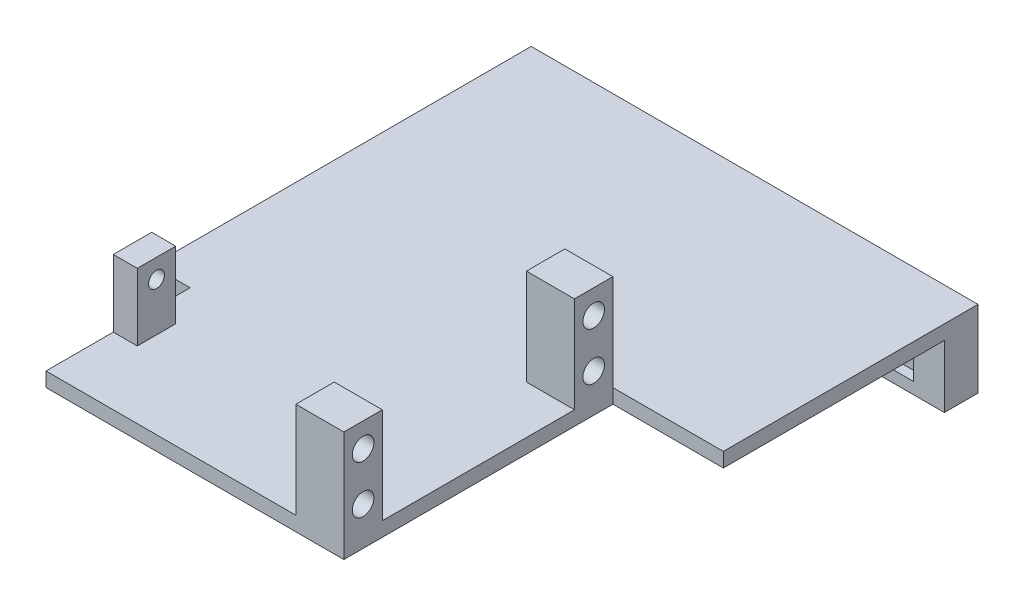
ISO-10303-21;
HEADER;
FILE_DESCRIPTION(('STEP AP214'),'2;1');
FILE_NAME('part.step','',(''),(''),'','','');
FILE_SCHEMA(('AUTOMOTIVE_DESIGN { 1 0 10303 214 1 1 1 1 }'));
ENDSEC;
DATA;
#1=APPLICATION_CONTEXT('core data for automotive mechanical design processes');
#2=APPLICATION_PROTOCOL_DEFINITION('international standard','automotive_design',2000,#1);
#3=PRODUCT_CONTEXT('',#1,'mechanical');
#4=PRODUCT('Part','Part','',(#3));
#5=PRODUCT_RELATED_PRODUCT_CATEGORY('part','',(#4));
#6=PRODUCT_DEFINITION_FORMATION('','',#4);
#7=PRODUCT_DEFINITION_CONTEXT('part definition',#1,'design');
#8=PRODUCT_DEFINITION('design','',#6,#7);
#9=PRODUCT_DEFINITION_SHAPE('','',#8);
#10=(LENGTH_UNIT() NAMED_UNIT(*) SI_UNIT(.MILLI.,.METRE.));
#11=(NAMED_UNIT(*) PLANE_ANGLE_UNIT() SI_UNIT($,.RADIAN.));
#12=(NAMED_UNIT(*) SI_UNIT($,.STERADIAN.) SOLID_ANGLE_UNIT());
#13=UNCERTAINTY_MEASURE_WITH_UNIT(LENGTH_MEASURE(1.E-05),#10,'distance_accuracy_value','');
#14=(GEOMETRIC_REPRESENTATION_CONTEXT(3) GLOBAL_UNCERTAINTY_ASSIGNED_CONTEXT((#13)) GLOBAL_UNIT_ASSIGNED_CONTEXT((#10,
#11,#12)) REPRESENTATION_CONTEXT('',''));
#15=CARTESIAN_POINT('',(0.,0.,0.));
#16=DIRECTION('',(0.,0.,1.));
#17=DIRECTION('',(1.,0.,0.));
#18=AXIS2_PLACEMENT_3D('',#15,#16,#17);
#19=CARTESIAN_POINT('',(0.,-10.,0.));
#20=DIRECTION('',(0.,-1.,0.));
#21=DIRECTION('',(0.,0.,-1.));
#22=AXIS2_PLACEMENT_3D('',#19,#20,#21);
#23=PLANE('',#22);
#24=DIRECTION('',(0.,0.,-1.));
#25=VECTOR('',#24,1.);
#26=CARTESIAN_POINT('',(-52.,-10.,28.));
#27=LINE('',#26,#25);
#28=CARTESIAN_POINT('',(-52.,-10.,6.00000000000001));
#29=VERTEX_POINT('',#28);
#30=CARTESIAN_POINT('',(-52.,-10.,-1.99999999999999));
#31=VERTEX_POINT('',#30);
#32=EDGE_CURVE('E225',#29,#31,#27,.T.);
#33=ORIENTED_EDGE('',*,*,#32,.F.);
#34=DIRECTION('',(-1.,0.,0.));
#35=VECTOR('',#34,1.);
#36=CARTESIAN_POINT('',(-47.,-10.,6.00000000000001));
#37=LINE('',#36,#35);
#38=CARTESIAN_POINT('',(-47.,-10.,6.00000000000001));
#39=VERTEX_POINT('',#38);
#40=EDGE_CURVE('E219',#39,#29,#37,.T.);
#41=ORIENTED_EDGE('',*,*,#40,.F.);
#42=DIRECTION('',(0.,0.,1.));
#43=VECTOR('',#42,1.);
#44=CARTESIAN_POINT('',(-47.,-10.,6.00000000000001));
#45=LINE('',#44,#43);
#46=CARTESIAN_POINT('',(-47.,-10.,14.));
#47=VERTEX_POINT('',#46);
#48=EDGE_CURVE('E205',#39,#47,#45,.T.);
#49=ORIENTED_EDGE('',*,*,#48,.T.);
#50=DIRECTION('',(-1.,0.,0.));
#51=VECTOR('',#50,1.);
#52=CARTESIAN_POINT('',(-47.,-10.,14.));
#53=LINE('',#52,#51);
#54=CARTESIAN_POINT('',(-52.,-10.,14.));
#55=VERTEX_POINT('',#54);
#56=EDGE_CURVE('E226',#47,#55,#53,.T.);
#57=ORIENTED_EDGE('',*,*,#56,.T.);
#58=CARTESIAN_POINT('',(-52.,-10.,28.));
#59=VERTEX_POINT('',#58);
#60=EDGE_CURVE('E270',#59,#55,#27,.T.);
#61=ORIENTED_EDGE('',*,*,#60,.F.);
#62=DIRECTION('',(-1.,0.,0.));
#63=VECTOR('',#62,1.);
#64=CARTESIAN_POINT('',(9.99999999999999,-10.,28.));
#65=LINE('',#64,#63);
#66=CARTESIAN_POINT('',(0.,-10.,28.));
#67=VERTEX_POINT('',#66);
#68=EDGE_CURVE('E346',#67,#59,#65,.T.);
#69=ORIENTED_EDGE('',*,*,#68,.F.);
#70=DIRECTION('',(0.,0.,-1.));
#71=VECTOR('',#70,1.);
#72=CARTESIAN_POINT('',(0.,-10.,28.));
#73=LINE('',#72,#71);
#74=CARTESIAN_POINT('',(0.,-10.,20.));
#75=VERTEX_POINT('',#74);
#76=EDGE_CURVE('E401',#67,#75,#73,.T.);
#77=ORIENTED_EDGE('',*,*,#76,.T.);
#78=DIRECTION('',(-1.,0.,0.));
#79=VECTOR('',#78,1.);
#80=CARTESIAN_POINT('',(10.,-10.,20.));
#81=LINE('',#80,#79);
#82=CARTESIAN_POINT('',(9.99999999999999,-10.,20.));
#83=VERTEX_POINT('',#82);
#84=EDGE_CURVE('E11',#83,#75,#81,.T.);
#85=ORIENTED_EDGE('',*,*,#84,.F.);
#86=DIRECTION('',(0.,0.,1.));
#87=VECTOR('',#86,1.);
#88=CARTESIAN_POINT('',(9.99999999999999,-10.,28.));
#89=LINE('',#88,#87);
#90=CARTESIAN_POINT('',(10.,-10.,-20.));
#91=VERTEX_POINT('',#90);
#92=EDGE_CURVE('E353',#91,#83,#89,.T.);
#93=ORIENTED_EDGE('',*,*,#92,.F.);
#94=DIRECTION('',(-1.,0.,0.));
#95=VECTOR('',#94,1.);
#96=CARTESIAN_POINT('',(10.,-10.,-20.));
#97=LINE('',#96,#95);
#98=CARTESIAN_POINT('',(0.,-10.,-20.));
#99=VERTEX_POINT('',#98);
#100=EDGE_CURVE('E292',#91,#99,#97,.T.);
#101=ORIENTED_EDGE('',*,*,#100,.T.);
#102=DIRECTION('',(0.,0.,-1.));
#103=VECTOR('',#102,1.);
#104=CARTESIAN_POINT('',(0.,-10.,-20.));
#105=LINE('',#104,#103);
#106=CARTESIAN_POINT('',(0.,-10.,-28.));
#107=VERTEX_POINT('',#106);
#108=EDGE_CURVE('E326',#99,#107,#105,.T.);
#109=ORIENTED_EDGE('',*,*,#108,.T.);
#110=DIRECTION('',(-1.,0.,0.));
#111=VECTOR('',#110,1.);
#112=CARTESIAN_POINT('',(10.,-10.,-28.));
#113=LINE('',#112,#111);
#114=CARTESIAN_POINT('',(10.,-10.,-28.));
#115=VERTEX_POINT('',#114);
#116=EDGE_CURVE('E311',#115,#107,#113,.T.);
#117=ORIENTED_EDGE('',*,*,#116,.F.);
#118=DIRECTION('',(-1.,0.,0.));
#119=VECTOR('',#118,1.);
#120=CARTESIAN_POINT('',(10.,-10.,-28.));
#121=LINE('',#120,#119);
#122=CARTESIAN_POINT('',(33.,-10.,-28.));
#123=VERTEX_POINT('',#122);
#124=EDGE_CURVE('E369',#123,#115,#121,.T.);
#125=ORIENTED_EDGE('',*,*,#124,.F.);
#126=DIRECTION('',(0.,0.,1.));
#127=VECTOR('',#126,1.);
#128=CARTESIAN_POINT('',(33.,-10.,-28.));
#129=LINE('',#128,#127);
#130=CARTESIAN_POINT('',(33.,-9.99999999999999,-81.));
#131=VERTEX_POINT('',#130);
#132=EDGE_CURVE('E367',#131,#123,#129,.T.);
#133=ORIENTED_EDGE('',*,*,#132,.F.);
#134=DIRECTION('',(1.,0.,0.));
#135=VECTOR('',#134,1.);
#136=CARTESIAN_POINT('',(-78.3575597506858,-9.99999999999999,-81.));
#137=LINE('',#136,#135);
#138=CARTESIAN_POINT('',(-60.,-9.99999999999999,-81.));
#139=VERTEX_POINT('',#138);
#140=EDGE_CURVE('E288',#139,#131,#137,.T.);
#141=ORIENTED_EDGE('',*,*,#140,.F.);
#142=DIRECTION('',(0.,0.,-1.));
#143=VECTOR('',#142,1.);
#144=CARTESIAN_POINT('',(-60.,-10.,28.));
#145=LINE('',#144,#143);
#146=CARTESIAN_POINT('',(-60.,-10.,-1.99999999999999));
#147=VERTEX_POINT('',#146);
#148=EDGE_CURVE('E365',#147,#139,#145,.T.);
#149=ORIENTED_EDGE('',*,*,#148,.F.);
#150=DIRECTION('',(-1.,0.,0.));
#151=VECTOR('',#150,1.);
#152=CARTESIAN_POINT('',(-60.,-10.,-1.99999999999999));
#153=LINE('',#152,#151);
#154=EDGE_CURVE('E273',#31,#147,#153,.T.);
#155=ORIENTED_EDGE('',*,*,#154,.F.);
#156=EDGE_LOOP('',(#33,#41,#49,#57,#61,#69,#77,#85,#93,#101,#109,#117,#125,#133,#141,#149,#155));
#157=FACE_BOUND('',#156,.T.);
#158=ADVANCED_FACE('F39',(#157),#23,.F.);
#159=CARTESIAN_POINT('',(10.,0.,0.));
#160=DIRECTION('',(1.,0.,0.));
#161=DIRECTION('',(0.,0.,-1.));
#162=AXIS2_PLACEMENT_3D('',#159,#160,#161);
#163=PLANE('',#162);
#164=CARTESIAN_POINT('',(10.,5.,24.));
#165=DIRECTION('',(1.,0.,0.));
#166=DIRECTION('',(0.,0.,-1.));
#167=AXIS2_PLACEMENT_3D('',#164,#165,#166);
#168=CIRCLE('',#167,2.25);
#169=CARTESIAN_POINT('',(10.,5.,21.75));
#170=VERTEX_POINT('',#169);
#171=EDGE_CURVE('E385',#170,#170,#168,.T.);
#172=ORIENTED_EDGE('',*,*,#171,.F.);
#173=EDGE_LOOP('',(#172));
#174=FACE_BOUND('',#173,.T.);
#175=DIRECTION('',(0.,-1.,0.));
#176=VECTOR('',#175,1.);
#177=CARTESIAN_POINT('',(10.,10.,28.));
#178=LINE('',#177,#176);
#179=CARTESIAN_POINT('',(10.,10.,28.));
#180=VERTEX_POINT('',#179);
#181=CARTESIAN_POINT('',(9.99999999999999,-13.,28.));
#182=VERTEX_POINT('',#181);
#183=EDGE_CURVE('E391',#180,#182,#178,.T.);
#184=ORIENTED_EDGE('',*,*,#183,.T.);
#185=DIRECTION('',(0.,0.,1.));
#186=VECTOR('',#185,1.);
#187=CARTESIAN_POINT('',(9.99999999999999,-13.,28.));
#188=LINE('',#187,#186);
#189=CARTESIAN_POINT('',(10.,-13.,-28.));
#190=VERTEX_POINT('',#189);
#191=EDGE_CURVE('E359',#190,#182,#188,.T.);
#192=ORIENTED_EDGE('',*,*,#191,.F.);
#193=DIRECTION('',(0.,1.,0.));
#194=VECTOR('',#193,1.);
#195=CARTESIAN_POINT('',(10.,-13.,-28.));
#196=LINE('',#195,#194);
#197=EDGE_CURVE('E362',#190,#115,#196,.T.);
#198=ORIENTED_EDGE('',*,*,#197,.T.);
#199=DIRECTION('',(0.,1.,0.));
#200=VECTOR('',#199,1.);
#201=CARTESIAN_POINT('',(10.,-10.,-28.));
#202=LINE('',#201,#200);
#203=CARTESIAN_POINT('',(10.,10.,-28.));
#204=VERTEX_POINT('',#203);
#205=EDGE_CURVE('E333',#115,#204,#202,.T.);
#206=ORIENTED_EDGE('',*,*,#205,.T.);
#207=DIRECTION('',(0.,0.,1.));
#208=VECTOR('',#207,1.);
#209=CARTESIAN_POINT('',(10.,10.,-20.));
#210=LINE('',#209,#208);
#211=CARTESIAN_POINT('',(10.,10.,-20.));
#212=VERTEX_POINT('',#211);
#213=EDGE_CURVE('E320',#204,#212,#210,.T.);
#214=ORIENTED_EDGE('',*,*,#213,.T.);
#215=DIRECTION('',(0.,-1.,0.));
#216=VECTOR('',#215,1.);
#217=CARTESIAN_POINT('',(10.,-10.,-20.));
#218=LINE('',#217,#216);
#219=EDGE_CURVE('E324',#212,#91,#218,.T.);
#220=ORIENTED_EDGE('',*,*,#219,.T.);
#221=ORIENTED_EDGE('',*,*,#92,.T.);
#222=DIRECTION('',(0.,1.,0.));
#223=VECTOR('',#222,1.);
#224=CARTESIAN_POINT('',(10.,10.,20.));
#225=LINE('',#224,#223);
#226=CARTESIAN_POINT('',(10.,10.,20.));
#227=VERTEX_POINT('',#226);
#228=EDGE_CURVE('E393',#83,#227,#225,.T.);
#229=ORIENTED_EDGE('',*,*,#228,.T.);
#230=DIRECTION('',(0.,0.,1.));
#231=VECTOR('',#230,1.);
#232=CARTESIAN_POINT('',(10.,10.,28.));
#233=LINE('',#232,#231);
#234=EDGE_CURVE('E396',#227,#180,#233,.T.);
#235=ORIENTED_EDGE('',*,*,#234,.T.);
#236=EDGE_LOOP('',(#184,#192,#198,#206,#214,#220,#221,#229,#235));
#237=FACE_BOUND('',#236,.T.);
#238=CARTESIAN_POINT('',(10.,-5.,24.));
#239=DIRECTION('',(1.,0.,0.));
#240=DIRECTION('',(0.,0.,-1.));
#241=AXIS2_PLACEMENT_3D('',#238,#239,#240);
#242=CIRCLE('',#241,2.25);
#243=CARTESIAN_POINT('',(10.,-5.,21.75));
#244=VERTEX_POINT('',#243);
#245=EDGE_CURVE('E379',#244,#244,#242,.T.);
#246=ORIENTED_EDGE('',*,*,#245,.F.);
#247=EDGE_LOOP('',(#246));
#248=FACE_BOUND('',#247,.T.);
#249=CARTESIAN_POINT('',(10.,5.,-24.));
#250=DIRECTION('',(1.,0.,0.));
#251=DIRECTION('',(0.,0.,-1.));
#252=AXIS2_PLACEMENT_3D('',#249,#250,#251);
#253=CIRCLE('',#252,2.25);
#254=CARTESIAN_POINT('',(10.,5.,-26.25));
#255=VERTEX_POINT('',#254);
#256=EDGE_CURVE('E331',#255,#255,#253,.T.);
#257=ORIENTED_EDGE('',*,*,#256,.F.);
#258=EDGE_LOOP('',(#257));
#259=FACE_BOUND('',#258,.T.);
#260=CARTESIAN_POINT('',(10.,-5.,-24.));
#261=DIRECTION('',(1.,0.,0.));
#262=DIRECTION('',(0.,0.,-1.));
#263=AXIS2_PLACEMENT_3D('',#260,#261,#262);
#264=CIRCLE('',#263,2.25);
#265=CARTESIAN_POINT('',(10.,-5.,-26.25));
#266=VERTEX_POINT('',#265);
#267=EDGE_CURVE('E340',#266,#266,#264,.T.);
#268=ORIENTED_EDGE('',*,*,#267,.F.);
#269=EDGE_LOOP('',(#268));
#270=FACE_BOUND('',#269,.T.);
#271=ADVANCED_FACE('F428',(#174,#237,#248,#259,#270),#163,.T.);
#272=CARTESIAN_POINT('',(0.,0.,0.));
#273=DIRECTION('',(1.,0.,0.));
#274=DIRECTION('',(0.,0.,-1.));
#275=AXIS2_PLACEMENT_3D('',#272,#273,#274);
#276=PLANE('',#275);
#277=DIRECTION('',(0.,-1.,0.));
#278=VECTOR('',#277,1.);
#279=CARTESIAN_POINT('',(0.,10.,28.));
#280=LINE('',#279,#278);
#281=CARTESIAN_POINT('',(0.,10.,28.));
#282=VERTEX_POINT('',#281);
#283=EDGE_CURVE('E388',#282,#67,#280,.T.);
#284=ORIENTED_EDGE('',*,*,#283,.F.);
#285=DIRECTION('',(0.,0.,1.));
#286=VECTOR('',#285,1.);
#287=CARTESIAN_POINT('',(0.,10.,28.));
#288=LINE('',#287,#286);
#289=CARTESIAN_POINT('',(0.,10.,20.));
#290=VERTEX_POINT('',#289);
#291=EDGE_CURVE('E394',#290,#282,#288,.T.);
#292=ORIENTED_EDGE('',*,*,#291,.F.);
#293=DIRECTION('',(0.,1.,0.));
#294=VECTOR('',#293,1.);
#295=CARTESIAN_POINT('',(0.,10.,20.));
#296=LINE('',#295,#294);
#297=EDGE_CURVE('E403',#75,#290,#296,.T.);
#298=ORIENTED_EDGE('',*,*,#297,.F.);
#299=ORIENTED_EDGE('',*,*,#76,.F.);
#300=EDGE_LOOP('',(#284,#292,#298,#299));
#301=FACE_BOUND('',#300,.T.);
#302=CARTESIAN_POINT('',(0.,5.,24.));
#303=DIRECTION('',(1.,0.,0.));
#304=DIRECTION('',(0.,0.,-1.));
#305=AXIS2_PLACEMENT_3D('',#302,#303,#304);
#306=CIRCLE('',#305,2.25);
#307=CARTESIAN_POINT('',(0.,5.,21.75));
#308=VERTEX_POINT('',#307);
#309=EDGE_CURVE('E382',#308,#308,#306,.T.);
#310=ORIENTED_EDGE('',*,*,#309,.T.);
#311=EDGE_LOOP('',(#310));
#312=FACE_BOUND('',#311,.T.);
#313=CARTESIAN_POINT('',(0.,-5.,24.));
#314=DIRECTION('',(1.,0.,0.));
#315=DIRECTION('',(0.,0.,-1.));
#316=AXIS2_PLACEMENT_3D('',#313,#314,#315);
#317=CIRCLE('',#316,2.25);
#318=CARTESIAN_POINT('',(0.,-5.,21.75));
#319=VERTEX_POINT('',#318);
#320=EDGE_CURVE('E378',#319,#319,#317,.T.);
#321=ORIENTED_EDGE('',*,*,#320,.T.);
#322=EDGE_LOOP('',(#321));
#323=FACE_BOUND('',#322,.T.);
#324=ADVANCED_FACE('F419',(#301,#312,#323),#276,.F.);
#325=CARTESIAN_POINT('',(10.,10.,28.));
#326=DIRECTION('',(0.,0.,-1.));
#327=DIRECTION('',(-1.,0.,0.));
#328=AXIS2_PLACEMENT_3D('',#325,#326,#327);
#329=PLANE('',#328);
#330=ORIENTED_EDGE('',*,*,#68,.T.);
#331=DIRECTION('',(0.,1.,0.));
#332=VECTOR('',#331,1.);
#333=CARTESIAN_POINT('',(-52.,-26.001,28.));
#334=LINE('',#333,#332);
#335=CARTESIAN_POINT('',(-52.,-13.,28.));
#336=VERTEX_POINT('',#335);
#337=EDGE_CURVE('E275',#336,#59,#334,.T.);
#338=ORIENTED_EDGE('',*,*,#337,.F.);
#339=DIRECTION('',(-1.,0.,0.));
#340=VECTOR('',#339,1.);
#341=CARTESIAN_POINT('',(9.99999999999999,-13.,28.));
#342=LINE('',#341,#340);
#343=EDGE_CURVE('E349',#182,#336,#342,.T.);
#344=ORIENTED_EDGE('',*,*,#343,.F.);
#345=ORIENTED_EDGE('',*,*,#183,.F.);
#346=DIRECTION('',(-1.,0.,0.));
#347=VECTOR('',#346,1.);
#348=CARTESIAN_POINT('',(10.,10.,28.));
#349=LINE('',#348,#347);
#350=EDGE_CURVE('E398',#180,#282,#349,.T.);
#351=ORIENTED_EDGE('',*,*,#350,.T.);
#352=ORIENTED_EDGE('',*,*,#283,.T.);
#353=EDGE_LOOP('',(#330,#338,#344,#345,#351,#352));
#354=FACE_BOUND('',#353,.T.);
#355=ADVANCED_FACE('F41',(#354),#329,.F.);
#356=CARTESIAN_POINT('',(10.,10.,20.));
#357=DIRECTION('',(0.,0.,1.));
#358=DIRECTION('',(0.,-1.,0.));
#359=AXIS2_PLACEMENT_3D('',#356,#357,#358);
#360=PLANE('',#359);
#361=ORIENTED_EDGE('',*,*,#297,.T.);
#362=DIRECTION('',(-1.,0.,0.));
#363=VECTOR('',#362,1.);
#364=CARTESIAN_POINT('',(10.,10.,20.));
#365=LINE('',#364,#363);
#366=EDGE_CURVE('E47',#227,#290,#365,.T.);
#367=ORIENTED_EDGE('',*,*,#366,.F.);
#368=ORIENTED_EDGE('',*,*,#228,.F.);
#369=ORIENTED_EDGE('',*,*,#84,.T.);
#370=EDGE_LOOP('',(#361,#367,#368,#369));
#371=FACE_BOUND('',#370,.T.);
#372=ADVANCED_FACE('F510',(#371),#360,.F.);
#373=CARTESIAN_POINT('',(10.,10.,28.));
#374=DIRECTION('',(0.,-1.,0.));
#375=DIRECTION('',(0.,0.,-1.));
#376=AXIS2_PLACEMENT_3D('',#373,#374,#375);
#377=PLANE('',#376);
#378=ORIENTED_EDGE('',*,*,#291,.T.);
#379=ORIENTED_EDGE('',*,*,#350,.F.);
#380=ORIENTED_EDGE('',*,*,#234,.F.);
#381=ORIENTED_EDGE('',*,*,#366,.T.);
#382=EDGE_LOOP('',(#378,#379,#380,#381));
#383=FACE_BOUND('',#382,.T.);
#384=ADVANCED_FACE('F412',(#383),#377,.F.);
#385=CARTESIAN_POINT('',(10.,5.,24.));
#386=DIRECTION('',(-1.,0.,0.));
#387=DIRECTION('',(0.,0.,1.));
#388=AXIS2_PLACEMENT_3D('',#385,#386,#387);
#389=CYLINDRICAL_SURFACE('',#388,2.25);
#390=ORIENTED_EDGE('',*,*,#171,.T.);
#391=EDGE_LOOP('',(#390));
#392=FACE_BOUND('',#391,.T.);
#393=ORIENTED_EDGE('',*,*,#309,.F.);
#394=EDGE_LOOP('',(#393));
#395=FACE_BOUND('',#394,.T.);
#396=ADVANCED_FACE('F502',(#392,#395),#389,.F.);
#397=CARTESIAN_POINT('',(10.,-5.,24.));
#398=DIRECTION('',(-1.,0.,0.));
#399=DIRECTION('',(0.,0.,1.));
#400=AXIS2_PLACEMENT_3D('',#397,#398,#399);
#401=CYLINDRICAL_SURFACE('',#400,2.25);
#402=ORIENTED_EDGE('',*,*,#245,.T.);
#403=EDGE_LOOP('',(#402));
#404=FACE_BOUND('',#403,.T.);
#405=ORIENTED_EDGE('',*,*,#320,.F.);
#406=EDGE_LOOP('',(#405));
#407=FACE_BOUND('',#406,.T.);
#408=ADVANCED_FACE('F498',(#404,#407),#401,.F.);
#409=CARTESIAN_POINT('',(-60.,-13.,28.));
#410=DIRECTION('',(1.,0.,0.));
#411=DIRECTION('',(0.,0.,-1.));
#412=AXIS2_PLACEMENT_3D('',#409,#410,#411);
#413=PLANE('',#412);
#414=DIRECTION('',(0.,0.,-1.));
#415=VECTOR('',#414,1.);
#416=CARTESIAN_POINT('',(-60.,-13.,28.));
#417=LINE('',#416,#415);
#418=CARTESIAN_POINT('',(-60.,-13.,-1.99999999999999));
#419=VERTEX_POINT('',#418);
#420=CARTESIAN_POINT('',(-60.,-13.,-74.));
#421=VERTEX_POINT('',#420);
#422=EDGE_CURVE('E352',#419,#421,#417,.T.);
#423=ORIENTED_EDGE('',*,*,#422,.F.);
#424=DIRECTION('',(0.,1.,0.));
#425=VECTOR('',#424,1.);
#426=CARTESIAN_POINT('',(-60.,-26.001,-1.99999999999999));
#427=LINE('',#426,#425);
#428=EDGE_CURVE('E276',#419,#147,#427,.T.);
#429=ORIENTED_EDGE('',*,*,#428,.T.);
#430=ORIENTED_EDGE('',*,*,#148,.T.);
#431=DIRECTION('',(0.,-1.,0.));
#432=VECTOR('',#431,1.);
#433=CARTESIAN_POINT('',(-60.,-9.99999999999999,-81.));
#434=LINE('',#433,#432);
#435=CARTESIAN_POINT('',(-60.,-26.,-81.));
#436=VERTEX_POINT('',#435);
#437=EDGE_CURVE('E290',#139,#436,#434,.T.);
#438=ORIENTED_EDGE('',*,*,#437,.T.);
#439=DIRECTION('',(0.,0.,1.));
#440=VECTOR('',#439,1.);
#441=CARTESIAN_POINT('',(-60.,-26.,-81.));
#442=LINE('',#441,#440);
#443=CARTESIAN_POINT('',(-60.,-26.,-74.));
#444=VERTEX_POINT('',#443);
#445=EDGE_CURVE('E287',#436,#444,#442,.T.);
#446=ORIENTED_EDGE('',*,*,#445,.T.);
#447=DIRECTION('',(0.,1.,0.));
#448=VECTOR('',#447,1.);
#449=CARTESIAN_POINT('',(-60.,-26.,-74.));
#450=LINE('',#449,#448);
#451=EDGE_CURVE('E284',#444,#421,#450,.T.);
#452=ORIENTED_EDGE('',*,*,#451,.T.);
#453=EDGE_LOOP('',(#423,#429,#430,#438,#446,#452));
#454=FACE_BOUND('',#453,.T.);
#455=ADVANCED_FACE('F494',(#454),#413,.F.);
#456=CARTESIAN_POINT('',(33.,-13.,-28.));
#457=DIRECTION('',(-1.,0.,0.));
#458=DIRECTION('',(0.,0.,1.));
#459=AXIS2_PLACEMENT_3D('',#456,#457,#458);
#460=PLANE('',#459);
#461=ORIENTED_EDGE('',*,*,#132,.T.);
#462=DIRECTION('',(0.,1.,0.));
#463=VECTOR('',#462,1.);
#464=CARTESIAN_POINT('',(33.,-13.,-28.));
#465=LINE('',#464,#463);
#466=CARTESIAN_POINT('',(33.,-13.,-28.));
#467=VERTEX_POINT('',#466);
#468=EDGE_CURVE('E375',#467,#123,#465,.T.);
#469=ORIENTED_EDGE('',*,*,#468,.F.);
#470=DIRECTION('',(0.,0.,1.));
#471=VECTOR('',#470,1.);
#472=CARTESIAN_POINT('',(33.,-13.,-28.));
#473=LINE('',#472,#471);
#474=CARTESIAN_POINT('',(33.,-13.,-74.));
#475=VERTEX_POINT('',#474);
#476=EDGE_CURVE('E355',#475,#467,#473,.T.);
#477=ORIENTED_EDGE('',*,*,#476,.F.);
#478=DIRECTION('',(0.,-1.,0.));
#479=VECTOR('',#478,1.);
#480=CARTESIAN_POINT('',(33.,-26.,-74.));
#481=LINE('',#480,#479);
#482=CARTESIAN_POINT('',(33.,-26.,-74.));
#483=VERTEX_POINT('',#482);
#484=EDGE_CURVE('E279',#475,#483,#481,.T.);
#485=ORIENTED_EDGE('',*,*,#484,.T.);
#486=DIRECTION('',(0.,0.,-1.));
#487=VECTOR('',#486,1.);
#488=CARTESIAN_POINT('',(33.,-26.,-81.));
#489=LINE('',#488,#487);
#490=CARTESIAN_POINT('',(33.,-26.,-81.));
#491=VERTEX_POINT('',#490);
#492=EDGE_CURVE('E295',#483,#491,#489,.T.);
#493=ORIENTED_EDGE('',*,*,#492,.T.);
#494=DIRECTION('',(0.,1.,0.));
#495=VECTOR('',#494,1.);
#496=CARTESIAN_POINT('',(33.,-9.99999999999999,-81.));
#497=LINE('',#496,#495);
#498=EDGE_CURVE('E298',#491,#131,#497,.T.);
#499=ORIENTED_EDGE('',*,*,#498,.T.);
#500=EDGE_LOOP('',(#461,#469,#477,#485,#493,#499));
#501=FACE_BOUND('',#500,.T.);
#502=ADVANCED_FACE('F492',(#501),#460,.F.);
#503=CARTESIAN_POINT('',(10.,-13.,-28.));
#504=DIRECTION('',(0.,0.,-1.));
#505=DIRECTION('',(0.,1.,0.));
#506=AXIS2_PLACEMENT_3D('',#503,#504,#505);
#507=PLANE('',#506);
#508=ORIENTED_EDGE('',*,*,#124,.T.);
#509=ORIENTED_EDGE('',*,*,#197,.F.);
#510=DIRECTION('',(-1.,0.,0.));
#511=VECTOR('',#510,1.);
#512=CARTESIAN_POINT('',(10.,-13.,-28.));
#513=LINE('',#512,#511);
#514=EDGE_CURVE('E357',#467,#190,#513,.T.);
#515=ORIENTED_EDGE('',*,*,#514,.F.);
#516=ORIENTED_EDGE('',*,*,#468,.T.);
#517=EDGE_LOOP('',(#508,#509,#515,#516));
#518=FACE_BOUND('',#517,.T.);
#519=ADVANCED_FACE('F436',(#518),#507,.F.);
#520=CARTESIAN_POINT('',(0.,-13.,0.));
#521=DIRECTION('',(0.,-1.,0.));
#522=DIRECTION('',(0.,0.,-1.));
#523=AXIS2_PLACEMENT_3D('',#520,#521,#522);
#524=PLANE('',#523);
#525=DIRECTION('',(-1.,0.,0.));
#526=VECTOR('',#525,1.);
#527=CARTESIAN_POINT('',(-60.,-13.,-1.99999999999999));
#528=LINE('',#527,#526);
#529=CARTESIAN_POINT('',(-52.,-13.,-1.99999999999999));
#530=VERTEX_POINT('',#529);
#531=EDGE_CURVE('E267',#530,#419,#528,.T.);
#532=ORIENTED_EDGE('',*,*,#531,.T.);
#533=ORIENTED_EDGE('',*,*,#422,.T.);
#534=DIRECTION('',(1.,0.,0.));
#535=VECTOR('',#534,1.);
#536=CARTESIAN_POINT('',(-78.3575597506858,-13.,-74.));
#537=LINE('',#536,#535);
#538=EDGE_CURVE('E301',#421,#475,#537,.T.);
#539=ORIENTED_EDGE('',*,*,#538,.T.);
#540=ORIENTED_EDGE('',*,*,#476,.T.);
#541=ORIENTED_EDGE('',*,*,#514,.T.);
#542=ORIENTED_EDGE('',*,*,#191,.T.);
#543=ORIENTED_EDGE('',*,*,#343,.T.);
#544=DIRECTION('',(0.,0.,-1.));
#545=VECTOR('',#544,1.);
#546=CARTESIAN_POINT('',(-52.,-13.,28.));
#547=LINE('',#546,#545);
#548=EDGE_CURVE('E259',#336,#530,#547,.T.);
#549=ORIENTED_EDGE('',*,*,#548,.T.);
#550=EDGE_LOOP('',(#532,#533,#539,#540,#541,#542,#543,#549));
#551=FACE_BOUND('',#550,.T.);
#552=ADVANCED_FACE('F431',(#551),#524,.T.);
#553=CARTESIAN_POINT('',(0.,0.,0.));
#554=DIRECTION('',(-1.,0.,0.));
#555=DIRECTION('',(0.,0.,1.));
#556=AXIS2_PLACEMENT_3D('',#553,#554,#555);
#557=PLANE('',#556);
#558=CARTESIAN_POINT('',(0.,5.,-24.));
#559=DIRECTION('',(1.,0.,0.));
#560=DIRECTION('',(0.,0.,-1.));
#561=AXIS2_PLACEMENT_3D('',#558,#559,#560);
#562=CIRCLE('',#561,2.25);
#563=CARTESIAN_POINT('',(0.,5.,-26.25));
#564=VERTEX_POINT('',#563);
#565=EDGE_CURVE('E337',#564,#564,#562,.T.);
#566=ORIENTED_EDGE('',*,*,#565,.T.);
#567=EDGE_LOOP('',(#566));
#568=FACE_BOUND('',#567,.T.);
#569=DIRECTION('',(0.,-1.,0.));
#570=VECTOR('',#569,1.);
#571=CARTESIAN_POINT('',(0.,-10.,-20.));
#572=LINE('',#571,#570);
#573=CARTESIAN_POINT('',(0.,10.,-20.));
#574=VERTEX_POINT('',#573);
#575=EDGE_CURVE('E328',#574,#99,#572,.T.);
#576=ORIENTED_EDGE('',*,*,#575,.F.);
#577=DIRECTION('',(0.,0.,1.));
#578=VECTOR('',#577,1.);
#579=CARTESIAN_POINT('',(0.,10.,-20.));
#580=LINE('',#579,#578);
#581=CARTESIAN_POINT('',(0.,10.,-28.));
#582=VERTEX_POINT('',#581);
#583=EDGE_CURVE('E321',#582,#574,#580,.T.);
#584=ORIENTED_EDGE('',*,*,#583,.F.);
#585=DIRECTION('',(0.,1.,0.));
#586=VECTOR('',#585,1.);
#587=CARTESIAN_POINT('',(0.,-10.,-28.));
#588=LINE('',#587,#586);
#589=EDGE_CURVE('E323',#107,#582,#588,.T.);
#590=ORIENTED_EDGE('',*,*,#589,.F.);
#591=ORIENTED_EDGE('',*,*,#108,.F.);
#592=EDGE_LOOP('',(#576,#584,#590,#591));
#593=FACE_BOUND('',#592,.T.);
#594=CARTESIAN_POINT('',(0.,-5.,-24.));
#595=DIRECTION('',(1.,0.,0.));
#596=DIRECTION('',(0.,0.,-1.));
#597=AXIS2_PLACEMENT_3D('',#594,#595,#596);
#598=CIRCLE('',#597,2.25);
#599=CARTESIAN_POINT('',(0.,-5.,-26.25));
#600=VERTEX_POINT('',#599);
#601=EDGE_CURVE('E343',#600,#600,#598,.T.);
#602=ORIENTED_EDGE('',*,*,#601,.T.);
#603=EDGE_LOOP('',(#602));
#604=FACE_BOUND('',#603,.T.);
#605=ADVANCED_FACE('F456',(#568,#593,#604),#557,.T.);
#606=CARTESIAN_POINT('',(10.,-10.,-20.));
#607=DIRECTION('',(0.,0.,-1.));
#608=DIRECTION('',(-1.,0.,0.));
#609=AXIS2_PLACEMENT_3D('',#606,#607,#608);
#610=PLANE('',#609);
#611=ORIENTED_EDGE('',*,*,#575,.T.);
#612=ORIENTED_EDGE('',*,*,#100,.F.);
#613=ORIENTED_EDGE('',*,*,#219,.F.);
#614=DIRECTION('',(-1.,0.,0.));
#615=VECTOR('',#614,1.);
#616=CARTESIAN_POINT('',(10.,10.,-20.));
#617=LINE('',#616,#615);
#618=EDGE_CURVE('E317',#212,#574,#617,.T.);
#619=ORIENTED_EDGE('',*,*,#618,.T.);
#620=EDGE_LOOP('',(#611,#612,#613,#619));
#621=FACE_BOUND('',#620,.T.);
#622=ADVANCED_FACE('F452',(#621),#610,.F.);
#623=CARTESIAN_POINT('',(10.,-10.,-28.));
#624=DIRECTION('',(0.,0.,1.));
#625=DIRECTION('',(1.,0.,0.));
#626=AXIS2_PLACEMENT_3D('',#623,#624,#625);
#627=PLANE('',#626);
#628=ORIENTED_EDGE('',*,*,#589,.T.);
#629=DIRECTION('',(-1.,0.,0.));
#630=VECTOR('',#629,1.);
#631=CARTESIAN_POINT('',(10.,10.,-28.));
#632=LINE('',#631,#630);
#633=EDGE_CURVE('E314',#204,#582,#632,.T.);
#634=ORIENTED_EDGE('',*,*,#633,.F.);
#635=ORIENTED_EDGE('',*,*,#205,.F.);
#636=ORIENTED_EDGE('',*,*,#116,.T.);
#637=EDGE_LOOP('',(#628,#634,#635,#636));
#638=FACE_BOUND('',#637,.T.);
#639=ADVANCED_FACE('F441',(#638),#627,.F.);
#640=CARTESIAN_POINT('',(10.,10.,-20.));
#641=DIRECTION('',(0.,-1.,0.));
#642=DIRECTION('',(0.,0.,-1.));
#643=AXIS2_PLACEMENT_3D('',#640,#641,#642);
#644=PLANE('',#643);
#645=ORIENTED_EDGE('',*,*,#583,.T.);
#646=ORIENTED_EDGE('',*,*,#618,.F.);
#647=ORIENTED_EDGE('',*,*,#213,.F.);
#648=ORIENTED_EDGE('',*,*,#633,.T.);
#649=EDGE_LOOP('',(#645,#646,#647,#648));
#650=FACE_BOUND('',#649,.T.);
#651=ADVANCED_FACE('F447',(#650),#644,.F.);
#652=CARTESIAN_POINT('',(10.,5.,-24.));
#653=DIRECTION('',(-1.,0.,0.));
#654=DIRECTION('',(0.,0.,1.));
#655=AXIS2_PLACEMENT_3D('',#652,#653,#654);
#656=CYLINDRICAL_SURFACE('',#655,2.25);
#657=ORIENTED_EDGE('',*,*,#256,.T.);
#658=EDGE_LOOP('',(#657));
#659=FACE_BOUND('',#658,.T.);
#660=ORIENTED_EDGE('',*,*,#565,.F.);
#661=EDGE_LOOP('',(#660));
#662=FACE_BOUND('',#661,.T.);
#663=ADVANCED_FACE('F466',(#659,#662),#656,.F.);
#664=CARTESIAN_POINT('',(10.,-5.,-24.));
#665=DIRECTION('',(-1.,0.,0.));
#666=DIRECTION('',(0.,0.,1.));
#667=AXIS2_PLACEMENT_3D('',#664,#665,#666);
#668=CYLINDRICAL_SURFACE('',#667,2.25);
#669=ORIENTED_EDGE('',*,*,#267,.T.);
#670=EDGE_LOOP('',(#669));
#671=FACE_BOUND('',#670,.T.);
#672=ORIENTED_EDGE('',*,*,#601,.F.);
#673=EDGE_LOOP('',(#672));
#674=FACE_BOUND('',#673,.T.);
#675=ADVANCED_FACE('F463',(#671,#674),#668,.F.);
#676=CARTESIAN_POINT('',(-78.3575597506858,-9.99999999999999,-81.));
#677=DIRECTION('',(0.,0.,-1.));
#678=DIRECTION('',(-1.,0.,0.));
#679=AXIS2_PLACEMENT_3D('',#676,#677,#678);
#680=PLANE('',#679);
#681=ORIENTED_EDGE('',*,*,#437,.F.);
#682=ORIENTED_EDGE('',*,*,#140,.T.);
#683=ORIENTED_EDGE('',*,*,#498,.F.);
#684=DIRECTION('',(1.,0.,0.));
#685=VECTOR('',#684,1.);
#686=CARTESIAN_POINT('',(-78.3575597506858,-26.,-81.));
#687=LINE('',#686,#685);
#688=EDGE_CURVE('E304',#436,#491,#687,.T.);
#689=ORIENTED_EDGE('',*,*,#688,.F.);
#690=EDGE_LOOP('',(#681,#682,#683,#689));
#691=FACE_BOUND('',#690,.T.);
#692=ADVANCED_FACE('F465',(#691),#680,.T.);
#693=CARTESIAN_POINT('',(-78.3575597506858,-26.,-81.));
#694=DIRECTION('',(0.,-1.,0.));
#695=DIRECTION('',(1.,0.,0.));
#696=AXIS2_PLACEMENT_3D('',#693,#694,#695);
#697=PLANE('',#696);
#698=ORIENTED_EDGE('',*,*,#445,.F.);
#699=ORIENTED_EDGE('',*,*,#688,.T.);
#700=ORIENTED_EDGE('',*,*,#492,.F.);
#701=DIRECTION('',(1.,0.,0.));
#702=VECTOR('',#701,1.);
#703=CARTESIAN_POINT('',(-78.3575597506858,-26.,-74.));
#704=LINE('',#703,#702);
#705=EDGE_CURVE('E306',#444,#483,#704,.T.);
#706=ORIENTED_EDGE('',*,*,#705,.F.);
#707=EDGE_LOOP('',(#698,#699,#700,#706));
#708=FACE_BOUND('',#707,.T.);
#709=ADVANCED_FACE('F474',(#708),#697,.T.);
#710=CARTESIAN_POINT('',(-78.3575597506858,-26.,-74.));
#711=DIRECTION('',(0.,0.,1.));
#712=DIRECTION('',(1.,0.,0.));
#713=AXIS2_PLACEMENT_3D('',#710,#711,#712);
#714=PLANE('',#713);
#715=DIRECTION('',(0.,1.,0.));
#716=VECTOR('',#715,1.);
#717=CARTESIAN_POINT('',(26.6,-15.4,-74.));
#718=LINE('',#717,#716);
#719=CARTESIAN_POINT('',(26.6,-23.6,-74.));
#720=VERTEX_POINT('',#719);
#721=CARTESIAN_POINT('',(26.6,-15.4,-74.));
#722=VERTEX_POINT('',#721);
#723=EDGE_CURVE('E62',#720,#722,#718,.T.);
#724=ORIENTED_EDGE('',*,*,#723,.F.);
#725=DIRECTION('',(1.,0.,0.));
#726=VECTOR('',#725,1.);
#727=CARTESIAN_POINT('',(-53.6,-23.6,-74.));
#728=LINE('',#727,#726);
#729=CARTESIAN_POINT('',(-53.6,-23.6,-74.));
#730=VERTEX_POINT('',#729);
#731=EDGE_CURVE('E238',#730,#720,#728,.T.);
#732=ORIENTED_EDGE('',*,*,#731,.F.);
#733=DIRECTION('',(0.,-1.,0.));
#734=VECTOR('',#733,1.);
#735=CARTESIAN_POINT('',(-53.6,-15.4,-74.));
#736=LINE('',#735,#734);
#737=CARTESIAN_POINT('',(-53.6,-15.4,-74.));
#738=VERTEX_POINT('',#737);
#739=EDGE_CURVE('E252',#738,#730,#736,.T.);
#740=ORIENTED_EDGE('',*,*,#739,.F.);
#741=DIRECTION('',(-1.,0.,0.));
#742=VECTOR('',#741,1.);
#743=CARTESIAN_POINT('',(-53.6,-15.4,-74.));
#744=LINE('',#743,#742);
#745=EDGE_CURVE('E249',#722,#738,#744,.T.);
#746=ORIENTED_EDGE('',*,*,#745,.F.);
#747=EDGE_LOOP('',(#724,#732,#740,#746));
#748=FACE_BOUND('',#747,.T.);
#749=ORIENTED_EDGE('',*,*,#451,.F.);
#750=ORIENTED_EDGE('',*,*,#705,.T.);
#751=ORIENTED_EDGE('',*,*,#484,.F.);
#752=ORIENTED_EDGE('',*,*,#538,.F.);
#753=EDGE_LOOP('',(#749,#750,#751,#752));
#754=FACE_BOUND('',#753,.T.);
#755=ADVANCED_FACE('F531',(#748,#754),#714,.T.);
#756=CARTESIAN_POINT('',(-60.,-26.001,-1.99999999999999));
#757=DIRECTION('',(0.,0.,-1.));
#758=DIRECTION('',(0.,1.,0.));
#759=AXIS2_PLACEMENT_3D('',#756,#757,#758);
#760=PLANE('',#759);
#761=DIRECTION('',(0.,1.,0.));
#762=VECTOR('',#761,1.);
#763=CARTESIAN_POINT('',(-52.,-26.001,-1.99999999999999));
#764=LINE('',#763,#762);
#765=EDGE_CURVE('E280',#530,#31,#764,.T.);
#766=ORIENTED_EDGE('',*,*,#765,.T.);
#767=ORIENTED_EDGE('',*,*,#154,.T.);
#768=ORIENTED_EDGE('',*,*,#428,.F.);
#769=ORIENTED_EDGE('',*,*,#531,.F.);
#770=EDGE_LOOP('',(#766,#767,#768,#769));
#771=FACE_BOUND('',#770,.T.);
#772=ADVANCED_FACE('F543',(#771),#760,.F.);
#773=CARTESIAN_POINT('',(-52.,-26.001,28.));
#774=DIRECTION('',(1.,0.,0.));
#775=DIRECTION('',(0.,0.,-1.));
#776=AXIS2_PLACEMENT_3D('',#773,#774,#775);
#777=PLANE('',#776);
#778=ORIENTED_EDGE('',*,*,#337,.T.);
#779=ORIENTED_EDGE('',*,*,#60,.T.);
#780=DIRECTION('',(0.,1.,0.));
#781=VECTOR('',#780,1.);
#782=CARTESIAN_POINT('',(-52.,-10.,14.));
#783=LINE('',#782,#781);
#784=CARTESIAN_POINT('',(-52.,3.99999999999999,14.));
#785=VERTEX_POINT('',#784);
#786=EDGE_CURVE('E519',#55,#785,#783,.T.);
#787=ORIENTED_EDGE('',*,*,#786,.T.);
#788=DIRECTION('',(0.,0.,-1.));
#789=VECTOR('',#788,1.);
#790=CARTESIAN_POINT('',(-52.,3.99999999999999,6.00000000000001));
#791=LINE('',#790,#789);
#792=CARTESIAN_POINT('',(-52.,3.99999999999999,6.00000000000001));
#793=VERTEX_POINT('',#792);
#794=EDGE_CURVE('E222',#785,#793,#791,.T.);
#795=ORIENTED_EDGE('',*,*,#794,.T.);
#796=DIRECTION('',(0.,-1.,0.));
#797=VECTOR('',#796,1.);
#798=CARTESIAN_POINT('',(-52.,-10.,6.00000000000001));
#799=LINE('',#798,#797);
#800=EDGE_CURVE('E54',#793,#29,#799,.T.);
#801=ORIENTED_EDGE('',*,*,#800,.T.);
#802=ORIENTED_EDGE('',*,*,#32,.T.);
#803=ORIENTED_EDGE('',*,*,#765,.F.);
#804=ORIENTED_EDGE('',*,*,#548,.F.);
#805=EDGE_LOOP('',(#778,#779,#787,#795,#801,#802,#803,#804));
#806=FACE_BOUND('',#805,.T.);
#807=CARTESIAN_POINT('',(-52.,0.,10.));
#808=DIRECTION('',(-1.,0.,0.));
#809=DIRECTION('',(0.,0.,1.));
#810=AXIS2_PLACEMENT_3D('',#807,#808,#809);
#811=CIRCLE('',#810,1.65);
#812=CARTESIAN_POINT('',(-52.,0.,11.65));
#813=VERTEX_POINT('',#812);
#814=EDGE_CURVE('E727',#813,#813,#811,.T.);
#815=ORIENTED_EDGE('',*,*,#814,.F.);
#816=EDGE_LOOP('',(#815));
#817=FACE_BOUND('',#816,.T.);
#818=ADVANCED_FACE('F517',(#806,#817),#777,.F.);
#819=CARTESIAN_POINT('',(26.6,-15.4,-76.));
#820=DIRECTION('',(1.,0.,0.));
#821=DIRECTION('',(0.,0.,-1.));
#822=AXIS2_PLACEMENT_3D('',#819,#820,#821);
#823=PLANE('',#822);
#824=ORIENTED_EDGE('',*,*,#723,.T.);
#825=DIRECTION('',(0.,0.,1.));
#826=VECTOR('',#825,1.);
#827=CARTESIAN_POINT('',(26.6,-15.4,-76.));
#828=LINE('',#827,#826);
#829=CARTESIAN_POINT('',(26.6,-15.4,-76.));
#830=VERTEX_POINT('',#829);
#831=EDGE_CURVE('E247',#830,#722,#828,.T.);
#832=ORIENTED_EDGE('',*,*,#831,.F.);
#833=DIRECTION('',(0.,1.,0.));
#834=VECTOR('',#833,1.);
#835=CARTESIAN_POINT('',(26.6,-15.4,-76.));
#836=LINE('',#835,#834);
#837=CARTESIAN_POINT('',(26.6,-23.6,-76.));
#838=VERTEX_POINT('',#837);
#839=EDGE_CURVE('E234',#838,#830,#836,.T.);
#840=ORIENTED_EDGE('',*,*,#839,.F.);
#841=DIRECTION('',(0.,0.,1.));
#842=VECTOR('',#841,1.);
#843=CARTESIAN_POINT('',(26.6,-23.6,-76.));
#844=LINE('',#843,#842);
#845=EDGE_CURVE('E257',#838,#720,#844,.T.);
#846=ORIENTED_EDGE('',*,*,#845,.T.);
#847=EDGE_LOOP('',(#824,#832,#840,#846));
#848=FACE_BOUND('',#847,.T.);
#849=ADVANCED_FACE('F626',(#848),#823,.F.);
#850=CARTESIAN_POINT('',(-53.6,-23.6,-76.));
#851=DIRECTION('',(0.,-1.,0.));
#852=DIRECTION('',(0.,0.,-1.));
#853=AXIS2_PLACEMENT_3D('',#850,#851,#852);
#854=PLANE('',#853);
#855=ORIENTED_EDGE('',*,*,#731,.T.);
#856=ORIENTED_EDGE('',*,*,#845,.F.);
#857=DIRECTION('',(1.,0.,0.));
#858=VECTOR('',#857,1.);
#859=CARTESIAN_POINT('',(-53.6,-23.6,-76.));
#860=LINE('',#859,#858);
#861=CARTESIAN_POINT('',(-53.6,-23.6,-76.));
#862=VERTEX_POINT('',#861);
#863=EDGE_CURVE('E244',#862,#838,#860,.T.);
#864=ORIENTED_EDGE('',*,*,#863,.F.);
#865=DIRECTION('',(0.,0.,1.));
#866=VECTOR('',#865,1.);
#867=CARTESIAN_POINT('',(-53.6,-23.6,-76.));
#868=LINE('',#867,#866);
#869=EDGE_CURVE('E260',#862,#730,#868,.T.);
#870=ORIENTED_EDGE('',*,*,#869,.T.);
#871=EDGE_LOOP('',(#855,#856,#864,#870));
#872=FACE_BOUND('',#871,.T.);
#873=ADVANCED_FACE('F634',(#872),#854,.F.);
#874=CARTESIAN_POINT('',(-53.6,-15.4,-76.));
#875=DIRECTION('',(-1.,0.,0.));
#876=DIRECTION('',(0.,0.,1.));
#877=AXIS2_PLACEMENT_3D('',#874,#875,#876);
#878=PLANE('',#877);
#879=ORIENTED_EDGE('',*,*,#739,.T.);
#880=ORIENTED_EDGE('',*,*,#869,.F.);
#881=DIRECTION('',(0.,-1.,0.));
#882=VECTOR('',#881,1.);
#883=CARTESIAN_POINT('',(-53.6,-15.4,-76.));
#884=LINE('',#883,#882);
#885=CARTESIAN_POINT('',(-53.6,-15.4,-76.));
#886=VERTEX_POINT('',#885);
#887=EDGE_CURVE('E241',#886,#862,#884,.T.);
#888=ORIENTED_EDGE('',*,*,#887,.F.);
#889=DIRECTION('',(0.,0.,1.));
#890=VECTOR('',#889,1.);
#891=CARTESIAN_POINT('',(-53.6,-15.4,-76.));
#892=LINE('',#891,#890);
#893=EDGE_CURVE('E262',#886,#738,#892,.T.);
#894=ORIENTED_EDGE('',*,*,#893,.T.);
#895=EDGE_LOOP('',(#879,#880,#888,#894));
#896=FACE_BOUND('',#895,.T.);
#897=ADVANCED_FACE('F642',(#896),#878,.F.);
#898=CARTESIAN_POINT('',(-53.6,-15.4,-76.));
#899=DIRECTION('',(0.,1.,0.));
#900=DIRECTION('',(0.,0.,1.));
#901=AXIS2_PLACEMENT_3D('',#898,#899,#900);
#902=PLANE('',#901);
#903=ORIENTED_EDGE('',*,*,#745,.T.);
#904=ORIENTED_EDGE('',*,*,#893,.F.);
#905=DIRECTION('',(-1.,0.,0.));
#906=VECTOR('',#905,1.);
#907=CARTESIAN_POINT('',(-53.6,-15.4,-76.));
#908=LINE('',#907,#906);
#909=EDGE_CURVE('E237',#830,#886,#908,.T.);
#910=ORIENTED_EDGE('',*,*,#909,.F.);
#911=ORIENTED_EDGE('',*,*,#831,.T.);
#912=EDGE_LOOP('',(#903,#904,#910,#911));
#913=FACE_BOUND('',#912,.T.);
#914=ADVANCED_FACE('F651',(#913),#902,.F.);
#915=CARTESIAN_POINT('',(0.,0.,-76.));
#916=DIRECTION('',(0.,0.,1.));
#917=DIRECTION('',(1.,0.,0.));
#918=AXIS2_PLACEMENT_3D('',#915,#916,#917);
#919=PLANE('',#918);
#920=ORIENTED_EDGE('',*,*,#839,.T.);
#921=ORIENTED_EDGE('',*,*,#909,.T.);
#922=ORIENTED_EDGE('',*,*,#887,.T.);
#923=ORIENTED_EDGE('',*,*,#863,.T.);
#924=EDGE_LOOP('',(#920,#921,#922,#923));
#925=FACE_BOUND('',#924,.T.);
#926=ADVANCED_FACE('F660',(#925),#919,.T.);
#927=CARTESIAN_POINT('',(-47.,-10.,6.00000000000001));
#928=DIRECTION('',(0.,0.,-1.));
#929=DIRECTION('',(-1.,0.,0.));
#930=AXIS2_PLACEMENT_3D('',#927,#928,#929);
#931=PLANE('',#930);
#932=ORIENTED_EDGE('',*,*,#800,.F.);
#933=DIRECTION('',(-1.,0.,0.));
#934=VECTOR('',#933,1.);
#935=CARTESIAN_POINT('',(-47.,3.99999999999999,6.00000000000001));
#936=LINE('',#935,#934);
#937=CARTESIAN_POINT('',(-47.,3.99999999999999,6.00000000000001));
#938=VERTEX_POINT('',#937);
#939=EDGE_CURVE('E221',#938,#793,#936,.T.);
#940=ORIENTED_EDGE('',*,*,#939,.F.);
#941=DIRECTION('',(0.,-1.,0.));
#942=VECTOR('',#941,1.);
#943=CARTESIAN_POINT('',(-47.,-10.,6.00000000000001));
#944=LINE('',#943,#942);
#945=EDGE_CURVE('E209',#938,#39,#944,.T.);
#946=ORIENTED_EDGE('',*,*,#945,.T.);
#947=ORIENTED_EDGE('',*,*,#40,.T.);
#948=EDGE_LOOP('',(#932,#940,#946,#947));
#949=FACE_BOUND('',#948,.T.);
#950=ADVANCED_FACE('F218',(#949),#931,.T.);
#951=CARTESIAN_POINT('',(-47.,3.99999999999999,6.00000000000001));
#952=DIRECTION('',(0.,1.,0.));
#953=DIRECTION('',(0.,0.,1.));
#954=AXIS2_PLACEMENT_3D('',#951,#952,#953);
#955=PLANE('',#954);
#956=ORIENTED_EDGE('',*,*,#794,.F.);
#957=DIRECTION('',(-1.,0.,0.));
#958=VECTOR('',#957,1.);
#959=CARTESIAN_POINT('',(-47.,3.99999999999999,14.));
#960=LINE('',#959,#958);
#961=CARTESIAN_POINT('',(-47.,3.99999999999999,14.));
#962=VERTEX_POINT('',#961);
#963=EDGE_CURVE('E229',#962,#785,#960,.T.);
#964=ORIENTED_EDGE('',*,*,#963,.F.);
#965=DIRECTION('',(0.,0.,-1.));
#966=VECTOR('',#965,1.);
#967=CARTESIAN_POINT('',(-47.,3.99999999999999,6.00000000000001));
#968=LINE('',#967,#966);
#969=EDGE_CURVE('E227',#962,#938,#968,.T.);
#970=ORIENTED_EDGE('',*,*,#969,.T.);
#971=ORIENTED_EDGE('',*,*,#939,.T.);
#972=EDGE_LOOP('',(#956,#964,#970,#971));
#973=FACE_BOUND('',#972,.T.);
#974=ADVANCED_FACE('F676',(#973),#955,.T.);
#975=CARTESIAN_POINT('',(-47.,-10.,14.));
#976=DIRECTION('',(0.,0.,1.));
#977=DIRECTION('',(1.,0.,0.));
#978=AXIS2_PLACEMENT_3D('',#975,#976,#977);
#979=PLANE('',#978);
#980=ORIENTED_EDGE('',*,*,#786,.F.);
#981=ORIENTED_EDGE('',*,*,#56,.F.);
#982=DIRECTION('',(0.,1.,0.));
#983=VECTOR('',#982,1.);
#984=CARTESIAN_POINT('',(-47.,-10.,14.));
#985=LINE('',#984,#983);
#986=EDGE_CURVE('E212',#47,#962,#985,.T.);
#987=ORIENTED_EDGE('',*,*,#986,.T.);
#988=ORIENTED_EDGE('',*,*,#963,.T.);
#989=EDGE_LOOP('',(#980,#981,#987,#988));
#990=FACE_BOUND('',#989,.T.);
#991=ADVANCED_FACE('F684',(#990),#979,.T.);
#992=CARTESIAN_POINT('',(-47.,0.,0.));
#993=DIRECTION('',(1.,0.,0.));
#994=DIRECTION('',(0.,0.,-1.));
#995=AXIS2_PLACEMENT_3D('',#992,#993,#994);
#996=PLANE('',#995);
#997=CARTESIAN_POINT('',(-47.,0.,10.));
#998=DIRECTION('',(-1.,0.,0.));
#999=DIRECTION('',(0.,0.,1.));
#1000=AXIS2_PLACEMENT_3D('',#997,#998,#999);
#1001=CIRCLE('',#1000,1.65);
#1002=CARTESIAN_POINT('',(-47.,0.,11.65));
#1003=VERTEX_POINT('',#1002);
#1004=EDGE_CURVE('E724',#1003,#1003,#1001,.T.);
#1005=ORIENTED_EDGE('',*,*,#1004,.T.);
#1006=EDGE_LOOP('',(#1005));
#1007=FACE_BOUND('',#1006,.T.);
#1008=ORIENTED_EDGE('',*,*,#945,.F.);
#1009=ORIENTED_EDGE('',*,*,#969,.F.);
#1010=ORIENTED_EDGE('',*,*,#986,.F.);
#1011=ORIENTED_EDGE('',*,*,#48,.F.);
#1012=EDGE_LOOP('',(#1008,#1009,#1010,#1011));
#1013=FACE_BOUND('',#1012,.T.);
#1014=ADVANCED_FACE('F207',(#1007,#1013),#996,.T.);
#1015=CARTESIAN_POINT('',(-47.,0.,10.));
#1016=DIRECTION('',(-1.,0.,0.));
#1017=DIRECTION('',(0.,0.,1.));
#1018=AXIS2_PLACEMENT_3D('',#1015,#1016,#1017);
#1019=CYLINDRICAL_SURFACE('',#1018,1.65);
#1020=ORIENTED_EDGE('',*,*,#1004,.F.);
#1021=EDGE_LOOP('',(#1020));
#1022=FACE_BOUND('',#1021,.T.);
#1023=ORIENTED_EDGE('',*,*,#814,.T.);
#1024=EDGE_LOOP('',(#1023));
#1025=FACE_BOUND('',#1024,.T.);
#1026=ADVANCED_FACE('F701',(#1022,#1025),#1019,.F.);
#1027=CLOSED_SHELL('',(#158,#271,#324,#355,#372,#384,#396,#408,#455,#502,#519,#552,#605,#622,
#639,#651,#663,#675,#692,#709,#755,#772,#818,#849,#873,#897,#914,#926,#950,#974,#991,#1014,#1026));
#1028=MANIFOLD_SOLID_BREP('B2',#1027);
#1029=ADVANCED_BREP_SHAPE_REPRESENTATION('',(#18,#1028),#14);
#1030=SHAPE_DEFINITION_REPRESENTATION(#9,#1029);
ENDSEC;
END-ISO-10303-21;
